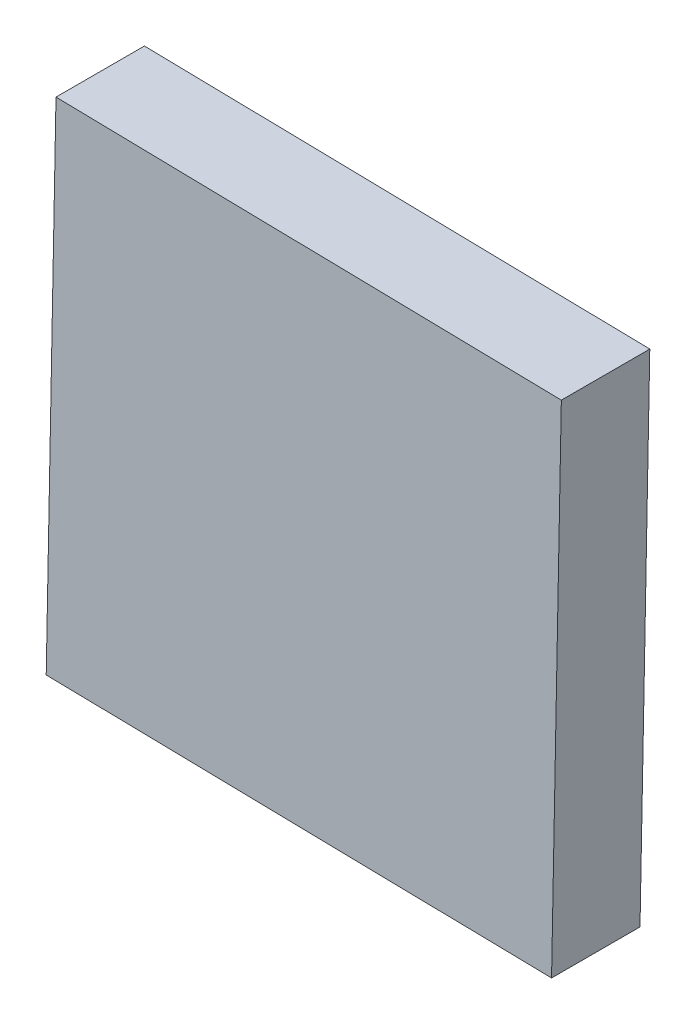
ISO-10303-21;
HEADER;
FILE_DESCRIPTION(('STEP AP214'),'2;1');
FILE_NAME('part.step','',(''),(''),'','','');
FILE_SCHEMA(('AUTOMOTIVE_DESIGN { 1 0 10303 214 1 1 1 1 }'));
ENDSEC;
DATA;
#1=APPLICATION_CONTEXT('core data for automotive mechanical design processes');
#2=APPLICATION_PROTOCOL_DEFINITION('international standard','automotive_design',2000,#1);
#3=PRODUCT_CONTEXT('',#1,'mechanical');
#4=PRODUCT('Part','Part','',(#3));
#5=PRODUCT_RELATED_PRODUCT_CATEGORY('part','',(#4));
#6=PRODUCT_DEFINITION_FORMATION('','',#4);
#7=PRODUCT_DEFINITION_CONTEXT('part definition',#1,'design');
#8=PRODUCT_DEFINITION('design','',#6,#7);
#9=PRODUCT_DEFINITION_SHAPE('','',#8);
#10=(LENGTH_UNIT() NAMED_UNIT(*) SI_UNIT(.MILLI.,.METRE.));
#11=(NAMED_UNIT(*) PLANE_ANGLE_UNIT() SI_UNIT($,.RADIAN.));
#12=(NAMED_UNIT(*) SI_UNIT($,.STERADIAN.) SOLID_ANGLE_UNIT());
#13=UNCERTAINTY_MEASURE_WITH_UNIT(LENGTH_MEASURE(1.E-05),#10,'distance_accuracy_value','');
#14=(GEOMETRIC_REPRESENTATION_CONTEXT(3) GLOBAL_UNCERTAINTY_ASSIGNED_CONTEXT((#13)) GLOBAL_UNIT_ASSIGNED_CONTEXT((#10,
#11,#12)) REPRESENTATION_CONTEXT('',''));
#15=CARTESIAN_POINT('',(0.,0.,0.));
#16=DIRECTION('',(0.,0.,1.));
#17=DIRECTION('',(1.,0.,0.));
#18=AXIS2_PLACEMENT_3D('',#15,#16,#17);
#19=CARTESIAN_POINT('',(-1.67734371468146,2.58988753102079,42.2620965279298));
#20=DIRECTION('',(0.,0.,1.));
#21=DIRECTION('',(0.999812677663925,-0.0193548335692301,0.));
#22=AXIS2_PLACEMENT_3D('',#19,#20,#21);
#23=PLANE('',#22);
#24=DIRECTION('',(0.0193548335692301,0.999812677663925,0.));
#25=VECTOR('',#24,1.);
#26=CARTESIAN_POINT('',(-4.26602919321367,0.0995246070202706,42.2620965279298));
#27=LINE('',#26,#25);
#28=CARTESIAN_POINT('',(-4.26602919321367,0.0995246070202706,42.2620965279298));
#29=VERTEX_POINT('',#28);
#30=CARTESIAN_POINT('',(-4.16770663868199,5.17857300955301,42.2620965279297));
#31=VERTEX_POINT('',#30);
#32=EDGE_CURVE('E58',#29,#31,#27,.T.);
#33=ORIENTED_EDGE('',*,*,#32,.T.);
#34=DIRECTION('',(0.999812677663925,-0.0193548335692299,0.));
#35=VECTOR('',#34,1.);
#36=CARTESIAN_POINT('',(-4.16770663868199,5.17857300955301,42.2620965279297));
#37=LINE('',#36,#35);
#38=CARTESIAN_POINT('',(0.911341763850753,5.08025045502132,42.2620965279299));
#39=VERTEX_POINT('',#38);
#40=EDGE_CURVE('E20',#31,#39,#37,.T.);
#41=ORIENTED_EDGE('',*,*,#40,.T.);
#42=DIRECTION('',(-0.0193548335692301,-0.999812677663925,0.));
#43=VECTOR('',#42,1.);
#44=CARTESIAN_POINT('',(0.813019209319064,0.00120205248858212,42.2620965279299));
#45=LINE('',#44,#43);
#46=CARTESIAN_POINT('',(0.813019209319064,0.00120205248858168,42.2620965279299));
#47=VERTEX_POINT('',#46);
#48=EDGE_CURVE('E89',#39,#47,#45,.T.);
#49=ORIENTED_EDGE('',*,*,#48,.T.);
#50=DIRECTION('',(-0.999812677663925,0.0193548335692299,0.));
#51=VECTOR('',#50,1.);
#52=CARTESIAN_POINT('',(-4.26602919321367,0.0995246070202706,42.2620965279298));
#53=LINE('',#52,#51);
#54=EDGE_CURVE('E56',#47,#29,#53,.T.);
#55=ORIENTED_EDGE('',*,*,#54,.T.);
#56=EDGE_LOOP('',(#33,#41,#49,#55));
#57=FACE_BOUND('',#56,.T.);
#58=ADVANCED_FACE('F17',(#57),#23,.F.);
#59=CARTESIAN_POINT('',(-4.16770663868202,5.17857300955302,43.1510965279297));
#60=DIRECTION('',(-0.0193548335692299,-0.999812677663925,0.));
#61=DIRECTION('',(0.999812677663925,-0.0193548335692299,0.));
#62=AXIS2_PLACEMENT_3D('',#59,#60,#61);
#63=PLANE('',#62);
#64=DIRECTION('',(0.,0.,1.));
#65=VECTOR('',#64,1.);
#66=CARTESIAN_POINT('',(0.911341763850724,5.08025045502133,43.1510965279299));
#67=LINE('',#66,#65);
#68=CARTESIAN_POINT('',(0.911341763850724,5.08025045502133,43.1510965279299));
#69=VERTEX_POINT('',#68);
#70=EDGE_CURVE('E70',#69,#39,#67,.F.);
#71=ORIENTED_EDGE('',*,*,#70,.T.);
#72=ORIENTED_EDGE('',*,*,#40,.F.);
#73=DIRECTION('',(0.,0.,1.));
#74=VECTOR('',#73,1.);
#75=CARTESIAN_POINT('',(-4.16770663868202,5.17857300955302,43.1510965279297));
#76=LINE('',#75,#74);
#77=CARTESIAN_POINT('',(-4.16770663868202,5.17857300955302,43.1510965279297));
#78=VERTEX_POINT('',#77);
#79=EDGE_CURVE('E65',#31,#78,#76,.T.);
#80=ORIENTED_EDGE('',*,*,#79,.T.);
#81=DIRECTION('',(0.999812677663925,-0.0193548335692301,0.));
#82=VECTOR('',#81,1.);
#83=CARTESIAN_POINT('',(-1.62818243741564,5.12941173228718,43.1510965279298));
#84=LINE('',#83,#82);
#85=EDGE_CURVE('E94',#69,#78,#84,.F.);
#86=ORIENTED_EDGE('',*,*,#85,.F.);
#87=EDGE_LOOP('',(#71,#72,#80,#86));
#88=FACE_BOUND('',#87,.T.);
#89=ADVANCED_FACE('F67',(#88),#63,.F.);
#90=CARTESIAN_POINT('',(-4.26602919321371,0.0995246070202831,43.1510965279298));
#91=DIRECTION('',(0.999812677663925,-0.0193548335692301,0.));
#92=DIRECTION('',(0.0193548335692301,0.999812677663925,0.));
#93=AXIS2_PLACEMENT_3D('',#90,#91,#92);
#94=PLANE('',#93);
#95=ORIENTED_EDGE('',*,*,#79,.F.);
#96=ORIENTED_EDGE('',*,*,#32,.F.);
#97=DIRECTION('',(0.,0.,1.));
#98=VECTOR('',#97,1.);
#99=CARTESIAN_POINT('',(-4.26602919321371,0.0995246070202831,43.1510965279298));
#100=LINE('',#99,#98);
#101=CARTESIAN_POINT('',(-4.26602919321371,0.0995246070202831,43.1510965279298));
#102=VERTEX_POINT('',#101);
#103=EDGE_CURVE('E83',#29,#102,#100,.T.);
#104=ORIENTED_EDGE('',*,*,#103,.T.);
#105=DIRECTION('',(0.0193548335692301,0.999812677663925,0.));
#106=VECTOR('',#105,1.);
#107=CARTESIAN_POINT('',(-4.21686791594786,2.63904880828665,43.1510965279297));
#108=LINE('',#107,#106);
#109=EDGE_CURVE('E75',#78,#102,#108,.F.);
#110=ORIENTED_EDGE('',*,*,#109,.F.);
#111=EDGE_LOOP('',(#95,#96,#104,#110));
#112=FACE_BOUND('',#111,.T.);
#113=ADVANCED_FACE('F73',(#112),#94,.F.);
#114=CARTESIAN_POINT('',(-4.26602919321371,0.0995246070202831,43.1510965279298));
#115=DIRECTION('',(0.0193548335692299,0.999812677663925,0.));
#116=DIRECTION('',(-0.999812677663925,0.0193548335692299,0.));
#117=AXIS2_PLACEMENT_3D('',#114,#115,#116);
#118=PLANE('',#117);
#119=ORIENTED_EDGE('',*,*,#103,.F.);
#120=ORIENTED_EDGE('',*,*,#54,.F.);
#121=DIRECTION('',(0.,0.,1.));
#122=VECTOR('',#121,1.);
#123=CARTESIAN_POINT('',(0.813019209319036,0.00120205248859426,43.15109652793));
#124=LINE('',#123,#122);
#125=CARTESIAN_POINT('',(0.813019209319036,0.00120205248859426,43.15109652793));
#126=VERTEX_POINT('',#125);
#127=EDGE_CURVE('E36',#47,#126,#124,.T.);
#128=ORIENTED_EDGE('',*,*,#127,.T.);
#129=DIRECTION('',(0.999812677663925,-0.0193548335692301,0.));
#130=VECTOR('',#129,1.);
#131=CARTESIAN_POINT('',(-1.72650499194733,0.0503633297544385,43.1510965279299));
#132=LINE('',#131,#130);
#133=EDGE_CURVE('E27',#102,#126,#132,.T.);
#134=ORIENTED_EDGE('',*,*,#133,.F.);
#135=EDGE_LOOP('',(#119,#120,#128,#134));
#136=FACE_BOUND('',#135,.T.);
#137=ADVANCED_FACE('F102',(#136),#118,.F.);
#138=CARTESIAN_POINT('',(0.813019209319036,0.00120205248859469,43.15109652793));
#139=DIRECTION('',(-0.999812677663925,0.0193548335692301,0.));
#140=DIRECTION('',(-0.0193548335692301,-0.999812677663925,0.));
#141=AXIS2_PLACEMENT_3D('',#138,#139,#140);
#142=PLANE('',#141);
#143=ORIENTED_EDGE('',*,*,#127,.F.);
#144=ORIENTED_EDGE('',*,*,#48,.F.);
#145=ORIENTED_EDGE('',*,*,#70,.F.);
#146=DIRECTION('',(0.0193548335692301,0.999812677663925,0.));
#147=VECTOR('',#146,1.);
#148=CARTESIAN_POINT('',(0.86218048658488,2.54072625375496,43.15109652793));
#149=LINE('',#148,#147);
#150=EDGE_CURVE('E11',#126,#69,#149,.T.);
#151=ORIENTED_EDGE('',*,*,#150,.F.);
#152=EDGE_LOOP('',(#143,#144,#145,#151));
#153=FACE_BOUND('',#152,.T.);
#154=ADVANCED_FACE('F104',(#153),#142,.F.);
#155=CARTESIAN_POINT('',(-1.67734371468149,2.58988753102081,43.1510965279299));
#156=DIRECTION('',(0.,0.,1.));
#157=DIRECTION('',(0.999812677663925,-0.0193548335692301,0.));
#158=AXIS2_PLACEMENT_3D('',#155,#156,#157);
#159=PLANE('',#158);
#160=ORIENTED_EDGE('',*,*,#133,.T.);
#161=ORIENTED_EDGE('',*,*,#150,.T.);
#162=ORIENTED_EDGE('',*,*,#85,.T.);
#163=ORIENTED_EDGE('',*,*,#109,.T.);
#164=EDGE_LOOP('',(#160,#161,#162,#163));
#165=FACE_BOUND('',#164,.T.);
#166=ADVANCED_FACE('F101',(#165),#159,.T.);
#167=CLOSED_SHELL('',(#58,#89,#113,#137,#154,#166));
#168=MANIFOLD_SOLID_BREP('B1',#167);
#169=ADVANCED_BREP_SHAPE_REPRESENTATION('',(#18,#168),#14);
#170=SHAPE_DEFINITION_REPRESENTATION(#9,#169);
ENDSEC;
END-ISO-10303-21;
